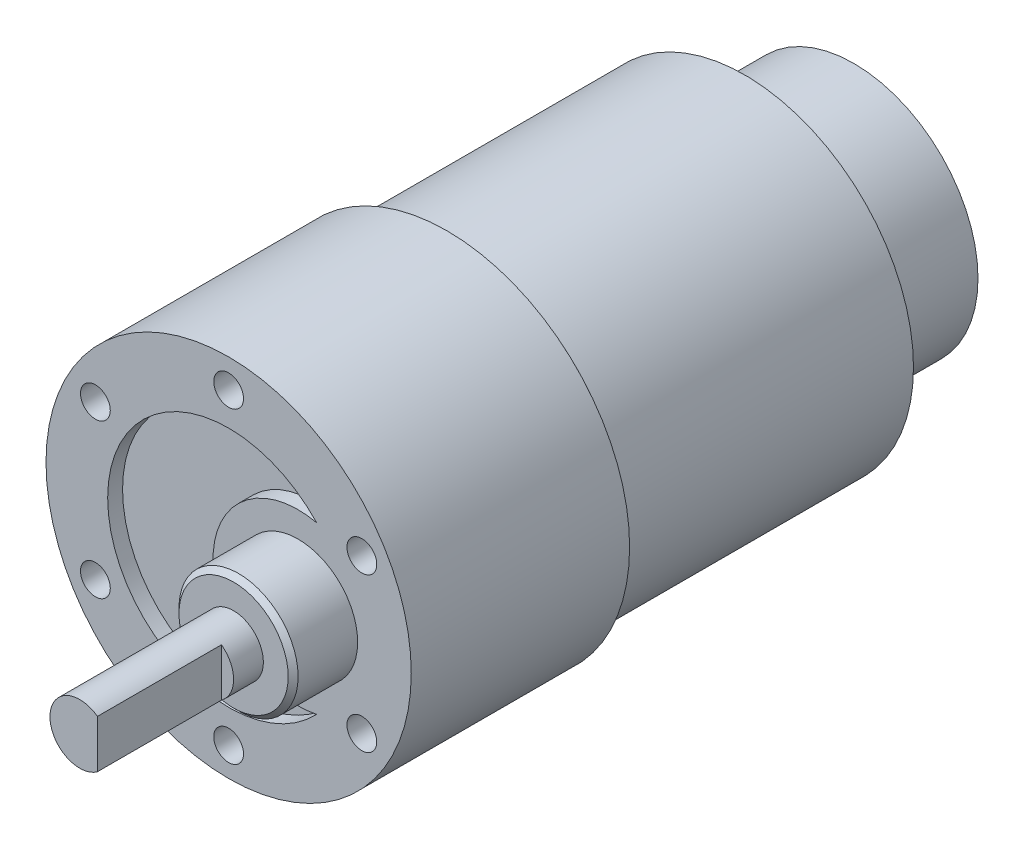
ISO-10303-21;
HEADER;
FILE_DESCRIPTION(('STEP AP214'),'2;1');
FILE_NAME('part.step','',(''),(''),'','','');
FILE_SCHEMA(('AUTOMOTIVE_DESIGN { 1 0 10303 214 1 1 1 1 }'));
ENDSEC;
DATA;
#1=APPLICATION_CONTEXT('core data for automotive mechanical design processes');
#2=APPLICATION_PROTOCOL_DEFINITION('international standard','automotive_design',2000,#1);
#3=PRODUCT_CONTEXT('',#1,'mechanical');
#4=PRODUCT('Part','Part','',(#3));
#5=PRODUCT_RELATED_PRODUCT_CATEGORY('part','',(#4));
#6=PRODUCT_DEFINITION_FORMATION('','',#4);
#7=PRODUCT_DEFINITION_CONTEXT('part definition',#1,'design');
#8=PRODUCT_DEFINITION('design','',#6,#7);
#9=PRODUCT_DEFINITION_SHAPE('','',#8);
#10=(LENGTH_UNIT() NAMED_UNIT(*) SI_UNIT(.MILLI.,.METRE.));
#11=(NAMED_UNIT(*) PLANE_ANGLE_UNIT() SI_UNIT($,.RADIAN.));
#12=(NAMED_UNIT(*) SI_UNIT($,.STERADIAN.) SOLID_ANGLE_UNIT());
#13=UNCERTAINTY_MEASURE_WITH_UNIT(LENGTH_MEASURE(1.E-05),#10,'distance_accuracy_value','');
#14=(GEOMETRIC_REPRESENTATION_CONTEXT(3) GLOBAL_UNCERTAINTY_ASSIGNED_CONTEXT((#13)) GLOBAL_UNIT_ASSIGNED_CONTEXT((#10,
#11,#12)) REPRESENTATION_CONTEXT('',''));
#15=CARTESIAN_POINT('',(0.,0.,0.));
#16=DIRECTION('',(0.,0.,1.));
#17=DIRECTION('',(1.,0.,0.));
#18=AXIS2_PLACEMENT_3D('',#15,#16,#17);
#19=CARTESIAN_POINT('',(0.,0.,0.));
#20=DIRECTION('',(0.,0.,1.));
#21=DIRECTION('',(1.,0.,0.));
#22=AXIS2_PLACEMENT_3D('',#19,#20,#21);
#23=PLANE('',#22);
#24=CARTESIAN_POINT('',(0.,0.,0.));
#25=DIRECTION('',(0.,0.,1.));
#26=DIRECTION('',(1.,0.,0.));
#27=AXIS2_PLACEMENT_3D('',#24,#25,#26);
#28=CIRCLE('',#27,17.);
#29=CARTESIAN_POINT('',(17.,0.,0.));
#30=VERTEX_POINT('',#29);
#31=EDGE_CURVE('E170',#30,#30,#28,.T.);
#32=ORIENTED_EDGE('',*,*,#31,.F.);
#33=EDGE_LOOP('',(#32));
#34=FACE_BOUND('',#33,.T.);
#35=CARTESIAN_POINT('',(0.,0.,0.));
#36=DIRECTION('',(0.,0.,1.));
#37=DIRECTION('',(1.,0.,0.));
#38=AXIS2_PLACEMENT_3D('',#35,#36,#37);
#39=CIRCLE('',#38,12.5);
#40=CARTESIAN_POINT('',(12.5,0.,0.));
#41=VERTEX_POINT('',#40);
#42=EDGE_CURVE('E13',#41,#41,#39,.F.);
#43=ORIENTED_EDGE('',*,*,#42,.F.);
#44=EDGE_LOOP('',(#43));
#45=FACE_BOUND('',#44,.T.);
#46=ADVANCED_FACE('F43',(#34,#45),#23,.F.);
#47=CARTESIAN_POINT('',(0.,0.,52.));
#48=DIRECTION('',(0.,0.,1.));
#49=DIRECTION('',(1.,0.,0.));
#50=AXIS2_PLACEMENT_3D('',#47,#48,#49);
#51=PLANE('',#50);
#52=CARTESIAN_POINT('',(7.,0.,52.));
#53=DIRECTION('',(0.,0.,1.));
#54=DIRECTION('',(1.,0.,0.));
#55=AXIS2_PLACEMENT_3D('',#52,#53,#54);
#56=CIRCLE('',#55,6.);
#57=CARTESIAN_POINT('',(13.,0.,52.));
#58=VERTEX_POINT('',#57);
#59=EDGE_CURVE('E103',#58,#58,#56,.T.);
#60=ORIENTED_EDGE('',*,*,#59,.F.);
#61=EDGE_LOOP('',(#60));
#62=FACE_BOUND('',#61,.T.);
#63=CARTESIAN_POINT('',(-13.4233937586587,7.75000000000016,52.));
#64=DIRECTION('',(0.,0.,1.));
#65=DIRECTION('',(1.,0.,0.));
#66=AXIS2_PLACEMENT_3D('',#63,#64,#65);
#67=CIRCLE('',#66,1.5);
#68=CARTESIAN_POINT('',(-11.9233937586587,7.75000000000016,52.));
#69=VERTEX_POINT('',#68);
#70=EDGE_CURVE('E109',#69,#69,#67,.T.);
#71=ORIENTED_EDGE('',*,*,#70,.F.);
#72=EDGE_LOOP('',(#71));
#73=FACE_BOUND('',#72,.T.);
#74=CARTESIAN_POINT('',(-13.4233937586589,-7.74999999999987,52.));
#75=DIRECTION('',(0.,0.,1.));
#76=DIRECTION('',(1.,0.,0.));
#77=AXIS2_PLACEMENT_3D('',#74,#75,#76);
#78=CIRCLE('',#77,1.5);
#79=CARTESIAN_POINT('',(-11.9233937586589,-7.74999999999987,52.));
#80=VERTEX_POINT('',#79);
#81=EDGE_CURVE('E122',#80,#80,#78,.T.);
#82=ORIENTED_EDGE('',*,*,#81,.F.);
#83=EDGE_LOOP('',(#82));
#84=FACE_BOUND('',#83,.T.);
#85=CARTESIAN_POINT('',(-1.08235921504137E-13,-15.5,52.));
#86=DIRECTION('',(0.,0.,1.));
#87=DIRECTION('',(1.,0.,0.));
#88=AXIS2_PLACEMENT_3D('',#85,#86,#87);
#89=CIRCLE('',#88,1.5);
#90=CARTESIAN_POINT('',(1.49999999999989,-15.5,52.));
#91=VERTEX_POINT('',#90);
#92=EDGE_CURVE('E130',#91,#91,#89,.T.);
#93=ORIENTED_EDGE('',*,*,#92,.F.);
#94=EDGE_LOOP('',(#93));
#95=FACE_BOUND('',#94,.T.);
#96=CARTESIAN_POINT('',(13.4233937586588,-7.75000000000006,52.));
#97=DIRECTION('',(0.,0.,1.));
#98=DIRECTION('',(1.,0.,0.));
#99=AXIS2_PLACEMENT_3D('',#96,#97,#98);
#100=CIRCLE('',#99,1.5);
#101=CARTESIAN_POINT('',(14.9233937586588,-7.75000000000006,52.));
#102=VERTEX_POINT('',#101);
#103=EDGE_CURVE('E138',#102,#102,#100,.T.);
#104=ORIENTED_EDGE('',*,*,#103,.F.);
#105=EDGE_LOOP('',(#104));
#106=FACE_BOUND('',#105,.T.);
#107=CARTESIAN_POINT('',(13.4233937586588,7.74999999999997,52.));
#108=DIRECTION('',(0.,0.,1.));
#109=DIRECTION('',(1.,0.,0.));
#110=AXIS2_PLACEMENT_3D('',#107,#108,#109);
#111=CIRCLE('',#110,1.5);
#112=CARTESIAN_POINT('',(14.9233937586588,7.74999999999997,52.));
#113=VERTEX_POINT('',#112);
#114=EDGE_CURVE('E146',#113,#113,#111,.T.);
#115=ORIENTED_EDGE('',*,*,#114,.F.);
#116=EDGE_LOOP('',(#115));
#117=FACE_BOUND('',#116,.T.);
#118=CARTESIAN_POINT('',(0.,15.5,52.));
#119=DIRECTION('',(0.,0.,1.));
#120=DIRECTION('',(1.,0.,0.));
#121=AXIS2_PLACEMENT_3D('',#118,#119,#120);
#122=CIRCLE('',#121,1.5);
#123=CARTESIAN_POINT('',(1.5,15.5,52.));
#124=VERTEX_POINT('',#123);
#125=EDGE_CURVE('E154',#124,#124,#122,.T.);
#126=ORIENTED_EDGE('',*,*,#125,.F.);
#127=EDGE_LOOP('',(#126));
#128=FACE_BOUND('',#127,.T.);
#129=CARTESIAN_POINT('',(0.,0.,52.));
#130=DIRECTION('',(0.,0.,1.));
#131=DIRECTION('',(1.,0.,0.));
#132=AXIS2_PLACEMENT_3D('',#129,#130,#131);
#133=CIRCLE('',#132,18.4);
#134=CARTESIAN_POINT('',(18.4,0.,52.));
#135=VERTEX_POINT('',#134);
#136=EDGE_CURVE('E166',#135,#135,#133,.T.);
#137=ORIENTED_EDGE('',*,*,#136,.T.);
#138=EDGE_LOOP('',(#137));
#139=FACE_BOUND('',#138,.T.);
#140=CARTESIAN_POINT('',(0.,0.,52.));
#141=DIRECTION('',(0.,0.,1.));
#142=DIRECTION('',(1.,0.,0.));
#143=AXIS2_PLACEMENT_3D('',#140,#141,#142);
#144=CIRCLE('',#143,12.1872331613627);
#145=CARTESIAN_POINT('',(8.86813473528428,8.35971521322723,52.));
#146=VERTEX_POINT('',#145);
#147=CARTESIAN_POINT('',(8.86813473528428,-8.35971521322723,52.));
#148=VERTEX_POINT('',#147);
#149=EDGE_CURVE('E417',#146,#148,#144,.T.);
#150=ORIENTED_EDGE('',*,*,#149,.F.);
#151=CARTESIAN_POINT('',(7.,0.,52.));
#152=DIRECTION('',(0.,0.,1.));
#153=DIRECTION('',(1.,0.,0.));
#154=AXIS2_PLACEMENT_3D('',#151,#152,#153);
#155=CIRCLE('',#154,8.56590718111272);
#156=EDGE_CURVE('E67',#146,#148,#155,.T.);
#157=ORIENTED_EDGE('',*,*,#156,.T.);
#158=EDGE_LOOP('',(#150,#157));
#159=FACE_BOUND('',#158,.T.);
#160=ADVANCED_FACE('F203',(#62,#73,#84,#95,#106,#117,#128,#139,#159),#51,.T.);
#161=CARTESIAN_POINT('',(7.,0.,58.5));
#162=DIRECTION('',(0.,0.,1.));
#163=DIRECTION('',(1.,0.,0.));
#164=AXIS2_PLACEMENT_3D('',#161,#162,#163);
#165=PLANE('',#164);
#166=CARTESIAN_POINT('',(7.,0.,58.5));
#167=DIRECTION('',(0.,0.,1.));
#168=DIRECTION('',(1.,0.,0.));
#169=AXIS2_PLACEMENT_3D('',#166,#167,#168);
#170=CIRCLE('',#169,5.50000000000002);
#171=CARTESIAN_POINT('',(12.5,0.,58.5));
#172=VERTEX_POINT('',#171);
#173=EDGE_CURVE('E185',#172,#172,#170,.T.);
#174=ORIENTED_EDGE('',*,*,#173,.T.);
#175=EDGE_LOOP('',(#174));
#176=FACE_BOUND('',#175,.T.);
#177=CARTESIAN_POINT('',(7.,0.,58.5));
#178=DIRECTION('',(0.,0.,1.));
#179=DIRECTION('',(1.,0.,0.));
#180=AXIS2_PLACEMENT_3D('',#177,#178,#179);
#181=CIRCLE('',#180,3.);
#182=CARTESIAN_POINT('',(10.,0.,58.5));
#183=VERTEX_POINT('',#182);
#184=EDGE_CURVE('E104',#183,#183,#181,.T.);
#185=ORIENTED_EDGE('',*,*,#184,.F.);
#186=EDGE_LOOP('',(#185));
#187=FACE_BOUND('',#186,.T.);
#188=ADVANCED_FACE('F199',(#176,#187),#165,.T.);
#189=CARTESIAN_POINT('',(0.,0.,30.));
#190=DIRECTION('',(0.,0.,-1.));
#191=DIRECTION('',(-1.,0.,0.));
#192=AXIS2_PLACEMENT_3D('',#189,#190,#191);
#193=CYLINDRICAL_SURFACE('',#192,17.);
#194=CARTESIAN_POINT('',(0.,0.,29.));
#195=DIRECTION('',(0.,0.,1.));
#196=DIRECTION('',(1.,0.,0.));
#197=AXIS2_PLACEMENT_3D('',#194,#195,#196);
#198=CIRCLE('',#197,17.);
#199=CARTESIAN_POINT('',(17.,0.,29.));
#200=VERTEX_POINT('',#199);
#201=EDGE_CURVE('E181',#200,#200,#198,.F.);
#202=ORIENTED_EDGE('',*,*,#201,.T.);
#203=EDGE_LOOP('',(#202));
#204=FACE_BOUND('',#203,.T.);
#205=ORIENTED_EDGE('',*,*,#31,.T.);
#206=EDGE_LOOP('',(#205));
#207=FACE_BOUND('',#206,.T.);
#208=ADVANCED_FACE('F202',(#204,#207),#193,.T.);
#209=CARTESIAN_POINT('',(0.,0.,29.));
#210=DIRECTION('',(0.,0.,1.));
#211=DIRECTION('',(1.,0.,0.));
#212=AXIS2_PLACEMENT_3D('',#209,#210,#211);
#213=TOROIDAL_SURFACE('',#212,16.,1.);
#214=ORIENTED_EDGE('',*,*,#201,.F.);
#215=EDGE_LOOP('',(#214));
#216=FACE_BOUND('',#215,.T.);
#217=CARTESIAN_POINT('',(0.,0.,30.));
#218=DIRECTION('',(0.,0.,1.));
#219=DIRECTION('',(1.,0.,0.));
#220=AXIS2_PLACEMENT_3D('',#217,#218,#219);
#221=CIRCLE('',#220,16.);
#222=CARTESIAN_POINT('',(16.,0.,30.));
#223=VERTEX_POINT('',#222);
#224=EDGE_CURVE('E177',#223,#223,#221,.T.);
#225=ORIENTED_EDGE('',*,*,#224,.F.);
#226=EDGE_LOOP('',(#225));
#227=FACE_BOUND('',#226,.T.);
#228=ADVANCED_FACE('F228',(#216,#227),#213,.T.);
#229=CARTESIAN_POINT('',(0.,0.,52.));
#230=DIRECTION('',(0.,0.,-1.));
#231=DIRECTION('',(-1.,0.,0.));
#232=AXIS2_PLACEMENT_3D('',#229,#230,#231);
#233=CYLINDRICAL_SURFACE('',#232,18.4);
#234=ORIENTED_EDGE('',*,*,#136,.F.);
#235=EDGE_LOOP('',(#234));
#236=FACE_BOUND('',#235,.T.);
#237=CARTESIAN_POINT('',(0.,0.,30.));
#238=DIRECTION('',(0.,0.,1.));
#239=DIRECTION('',(1.,0.,0.));
#240=AXIS2_PLACEMENT_3D('',#237,#238,#239);
#241=CIRCLE('',#240,18.4);
#242=CARTESIAN_POINT('',(18.4,0.,30.));
#243=VERTEX_POINT('',#242);
#244=EDGE_CURVE('E162',#243,#243,#241,.T.);
#245=ORIENTED_EDGE('',*,*,#244,.T.);
#246=EDGE_LOOP('',(#245));
#247=FACE_BOUND('',#246,.T.);
#248=ADVANCED_FACE('F225',(#236,#247),#233,.T.);
#249=CARTESIAN_POINT('',(0.,0.,30.));
#250=DIRECTION('',(0.,0.,1.));
#251=DIRECTION('',(1.,0.,0.));
#252=AXIS2_PLACEMENT_3D('',#249,#250,#251);
#253=PLANE('',#252);
#254=ORIENTED_EDGE('',*,*,#224,.T.);
#255=EDGE_LOOP('',(#254));
#256=FACE_BOUND('',#255,.T.);
#257=ORIENTED_EDGE('',*,*,#244,.F.);
#258=EDGE_LOOP('',(#257));
#259=FACE_BOUND('',#258,.T.);
#260=ADVANCED_FACE('F235',(#256,#259),#253,.F.);
#261=CARTESIAN_POINT('',(0.,15.5,49.));
#262=DIRECTION('',(0.,0.,1.));
#263=DIRECTION('',(1.,0.,0.));
#264=AXIS2_PLACEMENT_3D('',#261,#262,#263);
#265=CYLINDRICAL_SURFACE('',#264,1.5);
#266=CARTESIAN_POINT('',(0.,15.5,49.));
#267=DIRECTION('',(0.,0.,1.));
#268=DIRECTION('',(1.,0.,0.));
#269=AXIS2_PLACEMENT_3D('',#266,#267,#268);
#270=CIRCLE('',#269,1.5);
#271=CARTESIAN_POINT('',(1.5,15.5,49.));
#272=VERTEX_POINT('',#271);
#273=EDGE_CURVE('E158',#272,#272,#270,.T.);
#274=ORIENTED_EDGE('',*,*,#273,.F.);
#275=EDGE_LOOP('',(#274));
#276=FACE_BOUND('',#275,.T.);
#277=ORIENTED_EDGE('',*,*,#125,.T.);
#278=EDGE_LOOP('',(#277));
#279=FACE_BOUND('',#278,.T.);
#280=ADVANCED_FACE('F243',(#276,#279),#265,.F.);
#281=CARTESIAN_POINT('',(0.,15.5,49.));
#282=DIRECTION('',(0.,0.,1.));
#283=DIRECTION('',(1.,0.,0.));
#284=AXIS2_PLACEMENT_3D('',#281,#282,#283);
#285=PLANE('',#284);
#286=ORIENTED_EDGE('',*,*,#273,.T.);
#287=EDGE_LOOP('',(#286));
#288=FACE_BOUND('',#287,.T.);
#289=ADVANCED_FACE('F249',(#288),#285,.T.);
#290=CARTESIAN_POINT('',(13.4233937586588,7.74999999999997,49.));
#291=DIRECTION('',(0.,0.,1.));
#292=DIRECTION('',(1.,0.,0.));
#293=AXIS2_PLACEMENT_3D('',#290,#291,#292);
#294=CYLINDRICAL_SURFACE('',#293,1.5);
#295=CARTESIAN_POINT('',(13.4233937586588,7.74999999999997,49.));
#296=DIRECTION('',(0.,0.,1.));
#297=DIRECTION('',(1.,0.,0.));
#298=AXIS2_PLACEMENT_3D('',#295,#296,#297);
#299=CIRCLE('',#298,1.5);
#300=CARTESIAN_POINT('',(14.9233937586588,7.74999999999997,49.));
#301=VERTEX_POINT('',#300);
#302=EDGE_CURVE('E150',#301,#301,#299,.T.);
#303=ORIENTED_EDGE('',*,*,#302,.F.);
#304=EDGE_LOOP('',(#303));
#305=FACE_BOUND('',#304,.T.);
#306=ORIENTED_EDGE('',*,*,#114,.T.);
#307=EDGE_LOOP('',(#306));
#308=FACE_BOUND('',#307,.T.);
#309=ADVANCED_FACE('F255',(#305,#308),#294,.F.);
#310=CARTESIAN_POINT('',(13.4233937586588,7.74999999999997,49.));
#311=DIRECTION('',(0.,0.,1.));
#312=DIRECTION('',(1.,0.,0.));
#313=AXIS2_PLACEMENT_3D('',#310,#311,#312);
#314=PLANE('',#313);
#315=ORIENTED_EDGE('',*,*,#302,.T.);
#316=EDGE_LOOP('',(#315));
#317=FACE_BOUND('',#316,.T.);
#318=ADVANCED_FACE('F259',(#317),#314,.T.);
#319=CARTESIAN_POINT('',(13.4233937586588,-7.75000000000006,49.));
#320=DIRECTION('',(0.,0.,1.));
#321=DIRECTION('',(1.,0.,0.));
#322=AXIS2_PLACEMENT_3D('',#319,#320,#321);
#323=CYLINDRICAL_SURFACE('',#322,1.5);
#324=CARTESIAN_POINT('',(13.4233937586588,-7.75000000000006,49.));
#325=DIRECTION('',(0.,0.,1.));
#326=DIRECTION('',(1.,0.,0.));
#327=AXIS2_PLACEMENT_3D('',#324,#325,#326);
#328=CIRCLE('',#327,1.5);
#329=CARTESIAN_POINT('',(14.9233937586588,-7.75000000000006,49.));
#330=VERTEX_POINT('',#329);
#331=EDGE_CURVE('E142',#330,#330,#328,.T.);
#332=ORIENTED_EDGE('',*,*,#331,.F.);
#333=EDGE_LOOP('',(#332));
#334=FACE_BOUND('',#333,.T.);
#335=ORIENTED_EDGE('',*,*,#103,.T.);
#336=EDGE_LOOP('',(#335));
#337=FACE_BOUND('',#336,.T.);
#338=ADVANCED_FACE('F263',(#334,#337),#323,.F.);
#339=CARTESIAN_POINT('',(13.4233937586588,-7.75000000000006,49.));
#340=DIRECTION('',(0.,0.,1.));
#341=DIRECTION('',(1.,0.,0.));
#342=AXIS2_PLACEMENT_3D('',#339,#340,#341);
#343=PLANE('',#342);
#344=ORIENTED_EDGE('',*,*,#331,.T.);
#345=EDGE_LOOP('',(#344));
#346=FACE_BOUND('',#345,.T.);
#347=ADVANCED_FACE('F267',(#346),#343,.T.);
#348=CARTESIAN_POINT('',(-1.08235921504137E-13,-15.5,49.));
#349=DIRECTION('',(0.,0.,1.));
#350=DIRECTION('',(1.,0.,0.));
#351=AXIS2_PLACEMENT_3D('',#348,#349,#350);
#352=CYLINDRICAL_SURFACE('',#351,1.5);
#353=CARTESIAN_POINT('',(-1.08235921504137E-13,-15.5,49.));
#354=DIRECTION('',(0.,0.,1.));
#355=DIRECTION('',(1.,0.,0.));
#356=AXIS2_PLACEMENT_3D('',#353,#354,#355);
#357=CIRCLE('',#356,1.5);
#358=CARTESIAN_POINT('',(1.49999999999989,-15.5,49.));
#359=VERTEX_POINT('',#358);
#360=EDGE_CURVE('E134',#359,#359,#357,.T.);
#361=ORIENTED_EDGE('',*,*,#360,.F.);
#362=EDGE_LOOP('',(#361));
#363=FACE_BOUND('',#362,.T.);
#364=ORIENTED_EDGE('',*,*,#92,.T.);
#365=EDGE_LOOP('',(#364));
#366=FACE_BOUND('',#365,.T.);
#367=ADVANCED_FACE('F271',(#363,#366),#352,.F.);
#368=CARTESIAN_POINT('',(-1.08235921504137E-13,-15.5,49.));
#369=DIRECTION('',(0.,0.,1.));
#370=DIRECTION('',(1.,0.,0.));
#371=AXIS2_PLACEMENT_3D('',#368,#369,#370);
#372=PLANE('',#371);
#373=ORIENTED_EDGE('',*,*,#360,.T.);
#374=EDGE_LOOP('',(#373));
#375=FACE_BOUND('',#374,.T.);
#376=ADVANCED_FACE('F275',(#375),#372,.T.);
#377=CARTESIAN_POINT('',(-13.4233937586589,-7.74999999999987,49.));
#378=DIRECTION('',(0.,0.,1.));
#379=DIRECTION('',(1.,0.,0.));
#380=AXIS2_PLACEMENT_3D('',#377,#378,#379);
#381=CYLINDRICAL_SURFACE('',#380,1.5);
#382=CARTESIAN_POINT('',(-13.4233937586589,-7.74999999999987,49.));
#383=DIRECTION('',(0.,0.,1.));
#384=DIRECTION('',(1.,0.,0.));
#385=AXIS2_PLACEMENT_3D('',#382,#383,#384);
#386=CIRCLE('',#385,1.5);
#387=CARTESIAN_POINT('',(-11.9233937586589,-7.74999999999987,49.));
#388=VERTEX_POINT('',#387);
#389=EDGE_CURVE('E126',#388,#388,#386,.T.);
#390=ORIENTED_EDGE('',*,*,#389,.F.);
#391=EDGE_LOOP('',(#390));
#392=FACE_BOUND('',#391,.T.);
#393=ORIENTED_EDGE('',*,*,#81,.T.);
#394=EDGE_LOOP('',(#393));
#395=FACE_BOUND('',#394,.T.);
#396=ADVANCED_FACE('F279',(#392,#395),#381,.F.);
#397=CARTESIAN_POINT('',(-13.4233937586589,-7.74999999999987,49.));
#398=DIRECTION('',(0.,0.,1.));
#399=DIRECTION('',(1.,0.,0.));
#400=AXIS2_PLACEMENT_3D('',#397,#398,#399);
#401=PLANE('',#400);
#402=ORIENTED_EDGE('',*,*,#389,.T.);
#403=EDGE_LOOP('',(#402));
#404=FACE_BOUND('',#403,.T.);
#405=ADVANCED_FACE('F283',(#404),#401,.T.);
#406=CARTESIAN_POINT('',(-13.4233937586587,7.75000000000016,49.));
#407=DIRECTION('',(0.,0.,1.));
#408=DIRECTION('',(1.,0.,0.));
#409=AXIS2_PLACEMENT_3D('',#406,#407,#408);
#410=CYLINDRICAL_SURFACE('',#409,1.5);
#411=CARTESIAN_POINT('',(-13.4233937586587,7.75000000000016,49.));
#412=DIRECTION('',(0.,0.,1.));
#413=DIRECTION('',(1.,0.,0.));
#414=AXIS2_PLACEMENT_3D('',#411,#412,#413);
#415=CIRCLE('',#414,1.5);
#416=CARTESIAN_POINT('',(-11.9233937586587,7.75000000000016,49.));
#417=VERTEX_POINT('',#416);
#418=EDGE_CURVE('E118',#417,#417,#415,.T.);
#419=ORIENTED_EDGE('',*,*,#418,.F.);
#420=EDGE_LOOP('',(#419));
#421=FACE_BOUND('',#420,.T.);
#422=ORIENTED_EDGE('',*,*,#70,.T.);
#423=EDGE_LOOP('',(#422));
#424=FACE_BOUND('',#423,.T.);
#425=ADVANCED_FACE('F287',(#421,#424),#410,.F.);
#426=CARTESIAN_POINT('',(-13.4233937586587,7.75000000000016,49.));
#427=DIRECTION('',(0.,0.,1.));
#428=DIRECTION('',(1.,0.,0.));
#429=AXIS2_PLACEMENT_3D('',#426,#427,#428);
#430=PLANE('',#429);
#431=ORIENTED_EDGE('',*,*,#418,.T.);
#432=EDGE_LOOP('',(#431));
#433=FACE_BOUND('',#432,.T.);
#434=ADVANCED_FACE('F291',(#433),#430,.T.);
#435=CARTESIAN_POINT('',(7.,0.,58.5));
#436=DIRECTION('',(0.,0.,-1.));
#437=DIRECTION('',(-1.,0.,0.));
#438=AXIS2_PLACEMENT_3D('',#435,#436,#437);
#439=CYLINDRICAL_SURFACE('',#438,6.);
#440=CARTESIAN_POINT('',(7.,0.,58.));
#441=DIRECTION('',(0.,0.,1.));
#442=DIRECTION('',(1.,0.,0.));
#443=AXIS2_PLACEMENT_3D('',#440,#441,#442);
#444=CIRCLE('',#443,6.);
#445=CARTESIAN_POINT('',(13.,0.,58.));
#446=VERTEX_POINT('',#445);
#447=EDGE_CURVE('E52',#446,#446,#444,.F.);
#448=ORIENTED_EDGE('',*,*,#447,.T.);
#449=EDGE_LOOP('',(#448));
#450=FACE_BOUND('',#449,.T.);
#451=ORIENTED_EDGE('',*,*,#59,.T.);
#452=EDGE_LOOP('',(#451));
#453=FACE_BOUND('',#452,.T.);
#454=ADVANCED_FACE('F192',(#450,#453),#439,.T.);
#455=CARTESIAN_POINT('',(7.,0.,58.5));
#456=DIRECTION('',(0.,0.,-1.));
#457=DIRECTION('',(-1.,0.,0.));
#458=AXIS2_PLACEMENT_3D('',#455,#456,#457);
#459=CONICAL_SURFACE('',#458,5.50000000000002,0.785398163397445);
#460=ORIENTED_EDGE('',*,*,#447,.F.);
#461=EDGE_LOOP('',(#460));
#462=FACE_BOUND('',#461,.T.);
#463=ORIENTED_EDGE('',*,*,#173,.F.);
#464=EDGE_LOOP('',(#463));
#465=FACE_BOUND('',#464,.T.);
#466=ADVANCED_FACE('F45',(#462,#465),#459,.T.);
#467=CARTESIAN_POINT('',(7.,0.,74.));
#468=DIRECTION('',(0.,0.,-1.));
#469=DIRECTION('',(-1.,0.,0.));
#470=AXIS2_PLACEMENT_3D('',#467,#468,#469);
#471=CYLINDRICAL_SURFACE('',#470,3.);
#472=CARTESIAN_POINT('',(7.,0.,74.));
#473=DIRECTION('',(0.,0.,1.));
#474=DIRECTION('',(1.,0.,0.));
#475=AXIS2_PLACEMENT_3D('',#472,#473,#474);
#476=CIRCLE('',#475,3.);
#477=CARTESIAN_POINT('',(8.77935190468652,2.41534817351214,74.));
#478=VERTEX_POINT('',#477);
#479=CARTESIAN_POINT('',(8.77935190468652,-2.41534817351214,74.));
#480=VERTEX_POINT('',#479);
#481=EDGE_CURVE('E96',#478,#480,#476,.T.);
#482=ORIENTED_EDGE('',*,*,#481,.F.);
#483=DIRECTION('',(0.,0.,1.));
#484=VECTOR('',#483,1.);
#485=CARTESIAN_POINT('',(8.77935190468652,2.41534817351214,53.5174696217939));
#486=LINE('',#485,#484);
#487=CARTESIAN_POINT('',(8.77935190468652,2.41534817351214,61.5));
#488=VERTEX_POINT('',#487);
#489=EDGE_CURVE('E59',#488,#478,#486,.T.);
#490=ORIENTED_EDGE('',*,*,#489,.F.);
#491=CARTESIAN_POINT('',(7.,0.,61.5));
#492=DIRECTION('',(0.,0.,1.));
#493=DIRECTION('',(1.,0.,0.));
#494=AXIS2_PLACEMENT_3D('',#491,#492,#493);
#495=CIRCLE('',#494,3.);
#496=CARTESIAN_POINT('',(8.77935190468652,-2.41534817351214,61.5));
#497=VERTEX_POINT('',#496);
#498=EDGE_CURVE('E98',#488,#497,#495,.F.);
#499=ORIENTED_EDGE('',*,*,#498,.T.);
#500=DIRECTION('',(0.,0.,1.));
#501=VECTOR('',#500,1.);
#502=CARTESIAN_POINT('',(8.77935190468652,-2.41534817351214,53.5174696217939));
#503=LINE('',#502,#501);
#504=EDGE_CURVE('E85',#497,#480,#503,.T.);
#505=ORIENTED_EDGE('',*,*,#504,.T.);
#506=EDGE_LOOP('',(#482,#490,#499,#505));
#507=FACE_BOUND('',#506,.T.);
#508=ORIENTED_EDGE('',*,*,#184,.T.);
#509=EDGE_LOOP('',(#508));
#510=FACE_BOUND('',#509,.T.);
#511=ADVANCED_FACE('F94',(#507,#510),#471,.T.);
#512=CARTESIAN_POINT('',(7.,0.,74.));
#513=DIRECTION('',(0.,0.,1.));
#514=DIRECTION('',(1.,0.,0.));
#515=AXIS2_PLACEMENT_3D('',#512,#513,#514);
#516=PLANE('',#515);
#517=DIRECTION('',(0.,-1.,0.));
#518=VECTOR('',#517,1.);
#519=CARTESIAN_POINT('',(8.77935190468652,2.41534817351214,74.));
#520=LINE('',#519,#518);
#521=EDGE_CURVE('E82',#478,#480,#520,.T.);
#522=ORIENTED_EDGE('',*,*,#521,.F.);
#523=ORIENTED_EDGE('',*,*,#481,.T.);
#524=EDGE_LOOP('',(#522,#523));
#525=FACE_BOUND('',#524,.T.);
#526=ADVANCED_FACE('F101',(#525),#516,.T.);
#527=CARTESIAN_POINT('',(7.,0.,50.5));
#528=DIRECTION('',(0.,0.,1.));
#529=DIRECTION('',(1.,0.,0.));
#530=AXIS2_PLACEMENT_3D('',#527,#528,#529);
#531=CYLINDRICAL_SURFACE('',#530,8.56590718111272);
#532=ORIENTED_EDGE('',*,*,#156,.F.);
#533=DIRECTION('',(0.,0.,1.));
#534=VECTOR('',#533,1.);
#535=CARTESIAN_POINT('',(8.86813473528428,8.35971521322723,50.5));
#536=LINE('',#535,#534);
#537=CARTESIAN_POINT('',(8.86813473528428,8.35971521322723,50.5));
#538=VERTEX_POINT('',#537);
#539=EDGE_CURVE('E115',#538,#146,#536,.T.);
#540=ORIENTED_EDGE('',*,*,#539,.F.);
#541=CARTESIAN_POINT('',(7.,0.,50.5));
#542=DIRECTION('',(0.,0.,1.));
#543=DIRECTION('',(1.,0.,0.));
#544=AXIS2_PLACEMENT_3D('',#541,#542,#543);
#545=CIRCLE('',#544,8.56590718111272);
#546=CARTESIAN_POINT('',(8.86813473528428,-8.35971521322723,50.5));
#547=VERTEX_POINT('',#546);
#548=EDGE_CURVE('E413',#538,#547,#545,.T.);
#549=ORIENTED_EDGE('',*,*,#548,.T.);
#550=DIRECTION('',(0.,0.,1.));
#551=VECTOR('',#550,1.);
#552=CARTESIAN_POINT('',(8.86813473528428,-8.35971521322723,50.5));
#553=LINE('',#552,#551);
#554=EDGE_CURVE('E112',#547,#148,#553,.T.);
#555=ORIENTED_EDGE('',*,*,#554,.T.);
#556=EDGE_LOOP('',(#532,#540,#549,#555));
#557=FACE_BOUND('',#556,.T.);
#558=ADVANCED_FACE('F211',(#557),#531,.T.);
#559=CARTESIAN_POINT('',(0.,0.,50.5));
#560=DIRECTION('',(0.,0.,1.));
#561=DIRECTION('',(1.,0.,0.));
#562=AXIS2_PLACEMENT_3D('',#559,#560,#561);
#563=CYLINDRICAL_SURFACE('',#562,12.1872331613627);
#564=ORIENTED_EDGE('',*,*,#149,.T.);
#565=ORIENTED_EDGE('',*,*,#554,.F.);
#566=CARTESIAN_POINT('',(0.,0.,50.5));
#567=DIRECTION('',(0.,0.,1.));
#568=DIRECTION('',(1.,0.,0.));
#569=AXIS2_PLACEMENT_3D('',#566,#567,#568);
#570=CIRCLE('',#569,12.1872331613627);
#571=EDGE_CURVE('E416',#538,#547,#570,.T.);
#572=ORIENTED_EDGE('',*,*,#571,.F.);
#573=ORIENTED_EDGE('',*,*,#539,.T.);
#574=EDGE_LOOP('',(#564,#565,#572,#573));
#575=FACE_BOUND('',#574,.T.);
#576=ADVANCED_FACE('F328',(#575),#563,.F.);
#577=CARTESIAN_POINT('',(0.,-40.6214213562373,50.5));
#578=DIRECTION('',(0.,0.,1.));
#579=DIRECTION('',(1.,0.,0.));
#580=AXIS2_PLACEMENT_3D('',#577,#578,#579);
#581=PLANE('',#580);
#582=ORIENTED_EDGE('',*,*,#548,.F.);
#583=ORIENTED_EDGE('',*,*,#571,.T.);
#584=EDGE_LOOP('',(#582,#583));
#585=FACE_BOUND('',#584,.T.);
#586=ADVANCED_FACE('F337',(#585),#581,.T.);
#587=CARTESIAN_POINT('',(0.,0.,-11.));
#588=DIRECTION('',(0.,0.,1.));
#589=DIRECTION('',(1.,0.,0.));
#590=AXIS2_PLACEMENT_3D('',#587,#588,#589);
#591=CYLINDRICAL_SURFACE('',#590,12.5);
#592=CARTESIAN_POINT('',(0.,0.,-11.));
#593=DIRECTION('',(0.,0.,-1.));
#594=DIRECTION('',(-1.,0.,0.));
#595=AXIS2_PLACEMENT_3D('',#592,#593,#594);
#596=CIRCLE('',#595,12.5);
#597=CARTESIAN_POINT('',(-12.5,0.,-11.));
#598=VERTEX_POINT('',#597);
#599=EDGE_CURVE('E409',#598,#598,#596,.T.);
#600=ORIENTED_EDGE('',*,*,#599,.F.);
#601=EDGE_LOOP('',(#600));
#602=FACE_BOUND('',#601,.T.);
#603=ORIENTED_EDGE('',*,*,#42,.T.);
#604=EDGE_LOOP('',(#603));
#605=FACE_BOUND('',#604,.T.);
#606=ADVANCED_FACE('F346',(#602,#605),#591,.T.);
#607=CARTESIAN_POINT('',(0.,0.,-11.));
#608=DIRECTION('',(0.,0.,-1.));
#609=DIRECTION('',(-1.,0.,0.));
#610=AXIS2_PLACEMENT_3D('',#607,#608,#609);
#611=PLANE('',#610);
#612=ORIENTED_EDGE('',*,*,#599,.T.);
#613=EDGE_LOOP('',(#612));
#614=FACE_BOUND('',#613,.T.);
#615=ADVANCED_FACE('F361',(#614),#611,.T.);
#616=CARTESIAN_POINT('',(8.77935190468652,2.41534817351214,53.5174696217939));
#617=DIRECTION('',(-1.,0.,0.));
#618=DIRECTION('',(0.,0.,1.));
#619=AXIS2_PLACEMENT_3D('',#616,#617,#618);
#620=PLANE('',#619);
#621=DIRECTION('',(0.,1.,0.));
#622=VECTOR('',#621,1.);
#623=CARTESIAN_POINT('',(8.77935190468652,2.41534817351214,61.5));
#624=LINE('',#623,#622);
#625=EDGE_CURVE('E401',#497,#488,#624,.T.);
#626=ORIENTED_EDGE('',*,*,#625,.T.);
#627=ORIENTED_EDGE('',*,*,#489,.T.);
#628=ORIENTED_EDGE('',*,*,#521,.T.);
#629=ORIENTED_EDGE('',*,*,#504,.F.);
#630=EDGE_LOOP('',(#626,#627,#628,#629));
#631=FACE_BOUND('',#630,.T.);
#632=ADVANCED_FACE('F84',(#631),#620,.F.);
#633=CARTESIAN_POINT('',(7.,0.,61.5));
#634=DIRECTION('',(0.,0.,1.));
#635=DIRECTION('',(1.,0.,0.));
#636=AXIS2_PLACEMENT_3D('',#633,#634,#635);
#637=PLANE('',#636);
#638=ORIENTED_EDGE('',*,*,#498,.F.);
#639=ORIENTED_EDGE('',*,*,#625,.F.);
#640=EDGE_LOOP('',(#638,#639));
#641=FACE_BOUND('',#640,.T.);
#642=ADVANCED_FACE('F388',(#641),#637,.T.);
#643=CLOSED_SHELL('',(#46,#160,#188,#208,#228,#248,#260,#280,#289,#309,#318,#338,#347,#367,#376,
#396,#405,#425,#434,#454,#466,#511,#526,#558,#576,#586,#606,#615,#632,#642));
#644=MANIFOLD_SOLID_BREP('B2',#643);
#645=ADVANCED_BREP_SHAPE_REPRESENTATION('',(#18,#644),#14);
#646=SHAPE_DEFINITION_REPRESENTATION(#9,#645);
ENDSEC;
END-ISO-10303-21;
